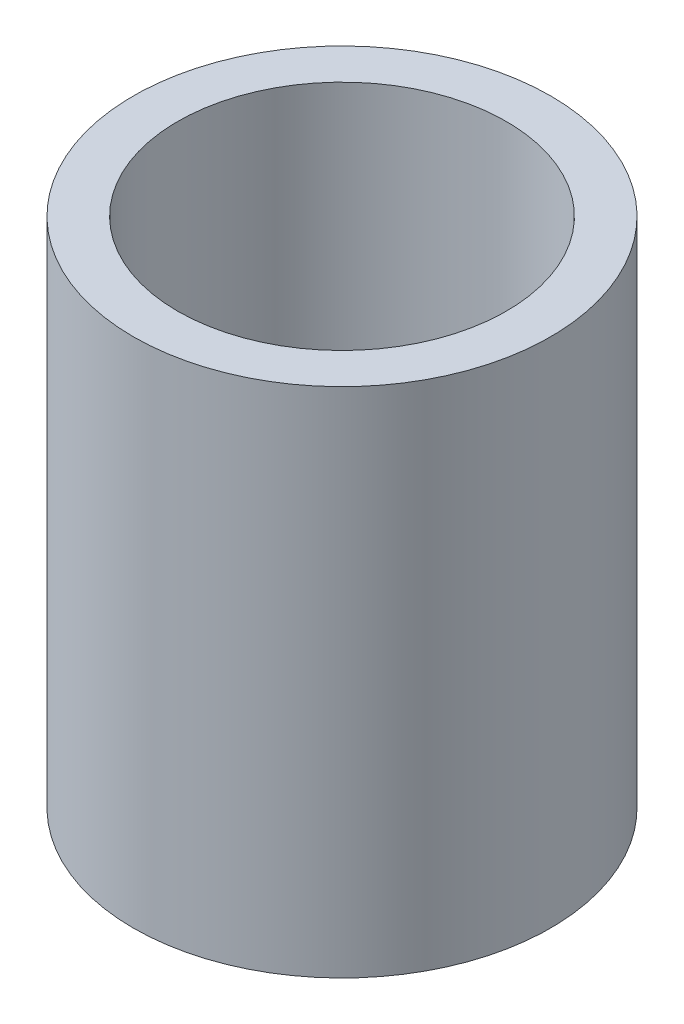
ISO-10303-21;
HEADER;
FILE_DESCRIPTION(('STEP AP214'),'2;1');
FILE_NAME('part.step','',(''),(''),'','','');
FILE_SCHEMA(('AUTOMOTIVE_DESIGN { 1 0 10303 214 1 1 1 1 }'));
ENDSEC;
DATA;
#1=APPLICATION_CONTEXT('core data for automotive mechanical design processes');
#2=APPLICATION_PROTOCOL_DEFINITION('international standard','automotive_design',2000,#1);
#3=PRODUCT_CONTEXT('',#1,'mechanical');
#4=PRODUCT('Part','Part','',(#3));
#5=PRODUCT_RELATED_PRODUCT_CATEGORY('part','',(#4));
#6=PRODUCT_DEFINITION_FORMATION('','',#4);
#7=PRODUCT_DEFINITION_CONTEXT('part definition',#1,'design');
#8=PRODUCT_DEFINITION('design','',#6,#7);
#9=PRODUCT_DEFINITION_SHAPE('','',#8);
#10=(LENGTH_UNIT() NAMED_UNIT(*) SI_UNIT(.MILLI.,.METRE.));
#11=(NAMED_UNIT(*) PLANE_ANGLE_UNIT() SI_UNIT($,.RADIAN.));
#12=(NAMED_UNIT(*) SI_UNIT($,.STERADIAN.) SOLID_ANGLE_UNIT());
#13=UNCERTAINTY_MEASURE_WITH_UNIT(LENGTH_MEASURE(1.E-05),#10,'distance_accuracy_value','');
#14=(GEOMETRIC_REPRESENTATION_CONTEXT(3) GLOBAL_UNCERTAINTY_ASSIGNED_CONTEXT((#13)) GLOBAL_UNIT_ASSIGNED_CONTEXT((#10,
#11,#12)) REPRESENTATION_CONTEXT('',''));
#15=CARTESIAN_POINT('',(0.,0.,0.));
#16=DIRECTION('',(0.,0.,1.));
#17=DIRECTION('',(1.,0.,0.));
#18=AXIS2_PLACEMENT_3D('',#15,#16,#17);
#19=CARTESIAN_POINT('',(0.,42.9563804369446,0.));
#20=DIRECTION('',(0.,-1.,0.));
#21=DIRECTION('',(0.,0.,-1.));
#22=AXIS2_PLACEMENT_3D('',#19,#20,#21);
#23=CYLINDRICAL_SURFACE('',#22,17.5);
#24=CARTESIAN_POINT('',(0.,42.9563804369446,0.));
#25=DIRECTION('',(0.,1.,0.));
#26=DIRECTION('',(0.,0.,1.));
#27=AXIS2_PLACEMENT_3D('',#24,#25,#26);
#28=CIRCLE('',#27,17.5);
#29=CARTESIAN_POINT('',(0.,42.9563804369446,17.5));
#30=VERTEX_POINT('',#29);
#31=EDGE_CURVE('E10',#30,#30,#28,.T.);
#32=ORIENTED_EDGE('',*,*,#31,.F.);
#33=EDGE_LOOP('',(#32));
#34=FACE_BOUND('',#33,.T.);
#35=CARTESIAN_POINT('',(0.,0.,0.));
#36=DIRECTION('',(0.,1.,0.));
#37=DIRECTION('',(0.,0.,1.));
#38=AXIS2_PLACEMENT_3D('',#35,#36,#37);
#39=CIRCLE('',#38,17.5);
#40=CARTESIAN_POINT('',(0.,0.,17.5));
#41=VERTEX_POINT('',#40);
#42=EDGE_CURVE('E37',#41,#41,#39,.T.);
#43=ORIENTED_EDGE('',*,*,#42,.T.);
#44=EDGE_LOOP('',(#43));
#45=FACE_BOUND('',#44,.T.);
#46=ADVANCED_FACE('F40',(#34,#45),#23,.T.);
#47=CARTESIAN_POINT('',(0.,42.9563804369446,0.));
#48=DIRECTION('',(0.,1.,0.));
#49=DIRECTION('',(0.,0.,1.));
#50=AXIS2_PLACEMENT_3D('',#47,#48,#49);
#51=PLANE('',#50);
#52=CARTESIAN_POINT('',(0.,42.9563804369446,0.));
#53=DIRECTION('',(0.,1.,0.));
#54=DIRECTION('',(0.,0.,1.));
#55=AXIS2_PLACEMENT_3D('',#52,#53,#54);
#56=CIRCLE('',#55,13.7850412319563);
#57=CARTESIAN_POINT('',(0.,42.9563804369446,13.7850412319563));
#58=VERTEX_POINT('',#57);
#59=EDGE_CURVE('E50',#58,#58,#56,.T.);
#60=ORIENTED_EDGE('',*,*,#59,.F.);
#61=EDGE_LOOP('',(#60));
#62=FACE_BOUND('',#61,.T.);
#63=ORIENTED_EDGE('',*,*,#31,.T.);
#64=EDGE_LOOP('',(#63));
#65=FACE_BOUND('',#64,.T.);
#66=ADVANCED_FACE('F59',(#62,#65),#51,.T.);
#67=CARTESIAN_POINT('',(0.,0.,0.));
#68=DIRECTION('',(0.,1.,0.));
#69=DIRECTION('',(0.,0.,1.));
#70=AXIS2_PLACEMENT_3D('',#67,#68,#69);
#71=PLANE('',#70);
#72=CARTESIAN_POINT('',(0.,0.,0.));
#73=DIRECTION('',(0.,1.,0.));
#74=DIRECTION('',(0.,0.,1.));
#75=AXIS2_PLACEMENT_3D('',#72,#73,#74);
#76=CIRCLE('',#75,13.7850412319563);
#77=CARTESIAN_POINT('',(0.,0.,13.7850412319563));
#78=VERTEX_POINT('',#77);
#79=EDGE_CURVE('E47',#78,#78,#76,.T.);
#80=ORIENTED_EDGE('',*,*,#79,.T.);
#81=EDGE_LOOP('',(#80));
#82=FACE_BOUND('',#81,.T.);
#83=ORIENTED_EDGE('',*,*,#42,.F.);
#84=EDGE_LOOP('',(#83));
#85=FACE_BOUND('',#84,.T.);
#86=ADVANCED_FACE('F58',(#82,#85),#71,.F.);
#87=CARTESIAN_POINT('',(0.,42.9563804369446,0.));
#88=DIRECTION('',(0.,-1.,0.));
#89=DIRECTION('',(0.,0.,-1.));
#90=AXIS2_PLACEMENT_3D('',#87,#88,#89);
#91=CYLINDRICAL_SURFACE('',#90,13.7850412319563);
#92=ORIENTED_EDGE('',*,*,#59,.T.);
#93=EDGE_LOOP('',(#92));
#94=FACE_BOUND('',#93,.T.);
#95=ORIENTED_EDGE('',*,*,#79,.F.);
#96=EDGE_LOOP('',(#95));
#97=FACE_BOUND('',#96,.T.);
#98=ADVANCED_FACE('F54',(#94,#97),#91,.F.);
#99=CLOSED_SHELL('',(#46,#66,#86,#98));
#100=MANIFOLD_SOLID_BREP('B2',#99);
#101=ADVANCED_BREP_SHAPE_REPRESENTATION('',(#18,#100),#14);
#102=SHAPE_DEFINITION_REPRESENTATION(#9,#101);
ENDSEC;
END-ISO-10303-21;
